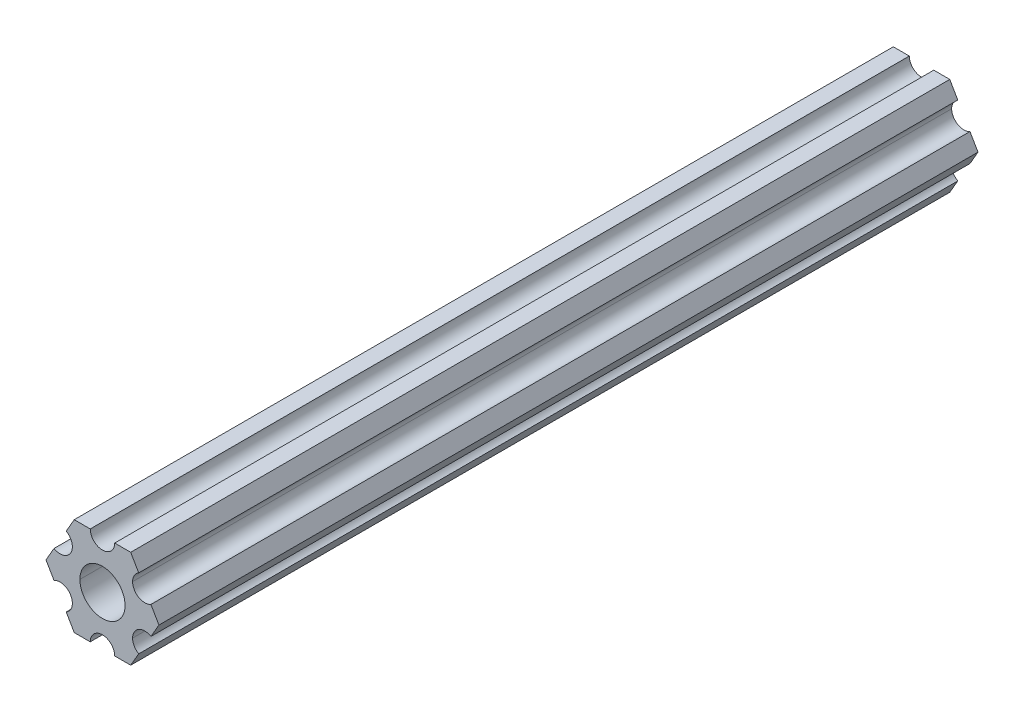
ISO-10303-21;
HEADER;
FILE_DESCRIPTION(('STEP AP214'),'2;1');
FILE_NAME('part.step','',(''),(''),'','','');
FILE_SCHEMA(('AUTOMOTIVE_DESIGN { 1 0 10303 214 1 1 1 1 }'));
ENDSEC;
DATA;
#1=APPLICATION_CONTEXT('core data for automotive mechanical design processes');
#2=APPLICATION_PROTOCOL_DEFINITION('international standard','automotive_design',2000,#1);
#3=PRODUCT_CONTEXT('',#1,'mechanical');
#4=PRODUCT('Part','Part','',(#3));
#5=PRODUCT_RELATED_PRODUCT_CATEGORY('part','',(#4));
#6=PRODUCT_DEFINITION_FORMATION('','',#4);
#7=PRODUCT_DEFINITION_CONTEXT('part definition',#1,'design');
#8=PRODUCT_DEFINITION('design','',#6,#7);
#9=PRODUCT_DEFINITION_SHAPE('','',#8);
#10=(LENGTH_UNIT() NAMED_UNIT(*) SI_UNIT(.MILLI.,.METRE.));
#11=(NAMED_UNIT(*) PLANE_ANGLE_UNIT() SI_UNIT($,.RADIAN.));
#12=(NAMED_UNIT(*) SI_UNIT($,.STERADIAN.) SOLID_ANGLE_UNIT());
#13=UNCERTAINTY_MEASURE_WITH_UNIT(LENGTH_MEASURE(1.E-05),#10,'distance_accuracy_value','');
#14=(GEOMETRIC_REPRESENTATION_CONTEXT(3) GLOBAL_UNCERTAINTY_ASSIGNED_CONTEXT((#13)) GLOBAL_UNIT_ASSIGNED_CONTEXT((#10,
#11,#12)) REPRESENTATION_CONTEXT('',''));
#15=CARTESIAN_POINT('',(0.,0.,0.));
#16=DIRECTION('',(0.,0.,1.));
#17=DIRECTION('',(1.,0.,0.));
#18=AXIS2_PLACEMENT_3D('',#15,#16,#17);
#19=CARTESIAN_POINT('',(0.,0.,304.8));
#20=DIRECTION('',(0.,0.,-1.));
#21=DIRECTION('',(-1.,0.,0.));
#22=AXIS2_PLACEMENT_3D('',#19,#20,#21);
#23=CYLINDRICAL_SURFACE('',#22,2.9337);
#24=CARTESIAN_POINT('',(0.,0.,106.3625));
#25=DIRECTION('',(0.,0.,1.));
#26=DIRECTION('',(1.,0.,0.));
#27=AXIS2_PLACEMENT_3D('',#24,#25,#26);
#28=CIRCLE('',#27,2.9337);
#29=CARTESIAN_POINT('',(2.9337,0.,106.3625));
#30=VERTEX_POINT('',#29);
#31=CARTESIAN_POINT('',(-2.9337,0.,106.3625));
#32=VERTEX_POINT('',#31);
#33=EDGE_CURVE('E75',#30,#32,#28,.T.);
#34=ORIENTED_EDGE('',*,*,#33,.T.);
#35=DIRECTION('',(0.,0.,-1.));
#36=VECTOR('',#35,1.);
#37=CARTESIAN_POINT('',(-2.9337,0.,304.8));
#38=LINE('',#37,#36);
#39=CARTESIAN_POINT('',(-2.9337,0.,0.));
#40=VERTEX_POINT('',#39);
#41=EDGE_CURVE('E360',#32,#40,#38,.T.);
#42=ORIENTED_EDGE('',*,*,#41,.T.);
#43=CARTESIAN_POINT('',(0.,0.,0.));
#44=DIRECTION('',(0.,0.,1.));
#45=DIRECTION('',(1.,0.,0.));
#46=AXIS2_PLACEMENT_3D('',#43,#44,#45);
#47=CIRCLE('',#46,2.9337);
#48=CARTESIAN_POINT('',(2.9337,0.,0.));
#49=VERTEX_POINT('',#48);
#50=EDGE_CURVE('E332',#49,#40,#47,.T.);
#51=ORIENTED_EDGE('',*,*,#50,.F.);
#52=DIRECTION('',(0.,0.,-1.));
#53=VECTOR('',#52,1.);
#54=CARTESIAN_POINT('',(2.9337,0.,304.8));
#55=LINE('',#54,#53);
#56=EDGE_CURVE('E364',#30,#49,#55,.T.);
#57=ORIENTED_EDGE('',*,*,#56,.F.);
#58=EDGE_LOOP('',(#34,#42,#51,#57));
#59=FACE_BOUND('',#58,.T.);
#60=ADVANCED_FACE('F53',(#59),#23,.F.);
#61=CARTESIAN_POINT('',(5.49926150638082,-3.17499966684067,304.8));
#62=DIRECTION('',(0.,0.,-1.));
#63=DIRECTION('',(-1.,0.,0.));
#64=AXIS2_PLACEMENT_3D('',#61,#62,#63);
#65=CYLINDRICAL_SURFACE('',#64,1.5875);
#66=CARTESIAN_POINT('',(5.4992615063808,-3.17499966684069,106.3625));
#67=DIRECTION('',(0.,0.,-1.));
#68=DIRECTION('',(1.,0.,0.));
#69=AXIS2_PLACEMENT_3D('',#66,#67,#68);
#70=CIRCLE('',#69,1.5875);
#71=CARTESIAN_POINT('',(4.70551169873047,-4.54981510640161,106.3625));
#72=VERTEX_POINT('',#71);
#73=CARTESIAN_POINT('',(3.91176150638082,-3.17499966684067,106.3625));
#74=VERTEX_POINT('',#73);
#75=EDGE_CURVE('E69',#72,#74,#70,.T.);
#76=ORIENTED_EDGE('',*,*,#75,.F.);
#77=DIRECTION('',(0.,0.,-1.));
#78=VECTOR('',#77,1.);
#79=CARTESIAN_POINT('',(4.70551158967065,-4.54981504343587,304.8));
#80=LINE('',#79,#78);
#81=CARTESIAN_POINT('',(4.70551158967065,-4.54981504343587,0.));
#82=VERTEX_POINT('',#81);
#83=EDGE_CURVE('E62',#72,#82,#80,.T.);
#84=ORIENTED_EDGE('',*,*,#83,.T.);
#85=CARTESIAN_POINT('',(5.49926150638082,-3.17499966684067,0.));
#86=DIRECTION('',(0.,0.,-1.));
#87=DIRECTION('',(1.,0.,0.));
#88=AXIS2_PLACEMENT_3D('',#85,#86,#87);
#89=CIRCLE('',#88,1.5875);
#90=CARTESIAN_POINT('',(3.91176150638082,-3.17499966684067,0.));
#91=VERTEX_POINT('',#90);
#92=EDGE_CURVE('E301',#82,#91,#89,.T.);
#93=ORIENTED_EDGE('',*,*,#92,.T.);
#94=DIRECTION('',(0.,0.,-1.));
#95=VECTOR('',#94,1.);
#96=CARTESIAN_POINT('',(3.91176150638082,-3.17499966684067,304.8));
#97=LINE('',#96,#95);
#98=EDGE_CURVE('E356',#74,#91,#97,.T.);
#99=ORIENTED_EDGE('',*,*,#98,.F.);
#100=EDGE_LOOP('',(#76,#84,#93,#99));
#101=FACE_BOUND('',#100,.T.);
#102=ADVANCED_FACE('F769',(#101),#65,.F.);
#103=CARTESIAN_POINT('',(3.66617459405346,-6.34999977789375,304.8));
#104=DIRECTION('',(-0.86602543407573,0.499999947533941,0.));
#105=DIRECTION('',(0.,0.,1.));
#106=AXIS2_PLACEMENT_3D('',#103,#104,#105);
#107=PLANE('',#106);
#108=DIRECTION('',(0.500000000000004,0.866025403784436,0.));
#109=VECTOR('',#108,1.);
#110=CARTESIAN_POINT('',(4.70551169873047,-4.54981510640161,106.3625));
#111=LINE('',#110,#109);
#112=CARTESIAN_POINT('',(3.66617459405343,-6.34999977789377,106.3625));
#113=VERTEX_POINT('',#112);
#114=EDGE_CURVE('E436',#113,#72,#111,.T.);
#115=ORIENTED_EDGE('',*,*,#114,.F.);
#116=DIRECTION('',(0.,0.,-1.));
#117=VECTOR('',#116,1.);
#118=CARTESIAN_POINT('',(3.66617459405346,-6.34999977789375,304.8));
#119=LINE('',#118,#117);
#120=CARTESIAN_POINT('',(3.66617459405346,-6.34999977789375,0.));
#121=VERTEX_POINT('',#120);
#122=EDGE_CURVE('E318',#113,#121,#119,.T.);
#123=ORIENTED_EDGE('',*,*,#122,.T.);
#124=DIRECTION('',(0.499999947533941,0.86602543407573,0.));
#125=VECTOR('',#124,1.);
#126=CARTESIAN_POINT('',(3.66617459405346,-6.34999977789375,0.));
#127=LINE('',#126,#125);
#128=EDGE_CURVE('E340',#121,#82,#127,.T.);
#129=ORIENTED_EDGE('',*,*,#128,.T.);
#130=ORIENTED_EDGE('',*,*,#83,.F.);
#131=EDGE_LOOP('',(#115,#123,#129,#130));
#132=FACE_BOUND('',#131,.T.);
#133=ADVANCED_FACE('F777',(#132),#107,.F.);
#134=CARTESIAN_POINT('',(1.58750038469926,-6.34999990382518,304.8));
#135=DIRECTION('',(-6.05825721258438E-08,1.,0.));
#136=DIRECTION('',(0.,0.,1.));
#137=AXIS2_PLACEMENT_3D('',#134,#135,#136);
#138=PLANE('',#137);
#139=DIRECTION('',(0.999999999999998,6.05825725431102E-08,0.));
#140=VECTOR('',#139,1.);
#141=CARTESIAN_POINT('',(3.66617459405343,-6.34999977789377,106.3625));
#142=LINE('',#141,#140);
#143=CARTESIAN_POINT('',(1.58750038469922,-6.3499999038252,106.3625));
#144=VERTEX_POINT('',#143);
#145=EDGE_CURVE('E433',#144,#113,#142,.T.);
#146=ORIENTED_EDGE('',*,*,#145,.F.);
#147=DIRECTION('',(0.,0.,-1.));
#148=VECTOR('',#147,1.);
#149=CARTESIAN_POINT('',(1.58750038469926,-6.34999990382518,304.8));
#150=LINE('',#149,#148);
#151=CARTESIAN_POINT('',(1.58750038469926,-6.34999990382518,0.));
#152=VERTEX_POINT('',#151);
#153=EDGE_CURVE('E333',#144,#152,#150,.T.);
#154=ORIENTED_EDGE('',*,*,#153,.T.);
#155=DIRECTION('',(1.,6.05825721258438E-08,0.));
#156=VECTOR('',#155,1.);
#157=CARTESIAN_POINT('',(1.58750038469926,-6.34999990382518,0.));
#158=LINE('',#157,#156);
#159=EDGE_CURVE('E350',#152,#121,#158,.T.);
#160=ORIENTED_EDGE('',*,*,#159,.T.);
#161=ORIENTED_EDGE('',*,*,#122,.F.);
#162=EDGE_LOOP('',(#146,#154,#160,#161));
#163=FACE_BOUND('',#162,.T.);
#164=ADVANCED_FACE('F785',(#163),#138,.F.);
#165=CARTESIAN_POINT('',(3.8469926204343E-07,-6.35,304.8));
#166=DIRECTION('',(0.,0.,-1.));
#167=DIRECTION('',(-1.,0.,0.));
#168=AXIS2_PLACEMENT_3D('',#165,#166,#167);
#169=CYLINDRICAL_SURFACE('',#168,1.5875);
#170=CARTESIAN_POINT('',(3.8469921571851E-07,-6.35,106.3625));
#171=DIRECTION('',(0.,0.,-1.));
#172=DIRECTION('',(1.,0.,0.));
#173=AXIS2_PLACEMENT_3D('',#170,#171,#172);
#174=CIRCLE('',#173,1.5875);
#175=CARTESIAN_POINT('',(-1.58749961530077,-6.35000022210626,106.3625));
#176=VERTEX_POINT('',#175);
#177=EDGE_CURVE('E430',#176,#144,#174,.T.);
#178=ORIENTED_EDGE('',*,*,#177,.F.);
#179=DIRECTION('',(0.,0.,-1.));
#180=VECTOR('',#179,1.);
#181=CARTESIAN_POINT('',(-1.58749961530073,-6.35000009617482,304.8));
#182=LINE('',#181,#180);
#183=CARTESIAN_POINT('',(-1.58749961530073,-6.35000009617482,0.));
#184=VERTEX_POINT('',#183);
#185=EDGE_CURVE('E336',#176,#184,#182,.T.);
#186=ORIENTED_EDGE('',*,*,#185,.T.);
#187=CARTESIAN_POINT('',(3.8469926204343E-07,-6.35,0.));
#188=DIRECTION('',(0.,0.,-1.));
#189=DIRECTION('',(1.,0.,0.));
#190=AXIS2_PLACEMENT_3D('',#187,#188,#189);
#191=CIRCLE('',#190,1.5875);
#192=EDGE_CURVE('E260',#184,#152,#191,.T.);
#193=ORIENTED_EDGE('',*,*,#192,.T.);
#194=ORIENTED_EDGE('',*,*,#153,.F.);
#195=EDGE_LOOP('',(#178,#186,#193,#194));
#196=FACE_BOUND('',#195,.T.);
#197=ADVANCED_FACE('F794',(#196),#169,.F.);
#198=CARTESIAN_POINT('',(-3.66617382465481,-6.35000022210628,304.8));
#199=DIRECTION('',(-6.05825854783851E-08,1.,0.));
#200=DIRECTION('',(0.,0.,1.));
#201=AXIS2_PLACEMENT_3D('',#198,#199,#200);
#202=PLANE('',#201);
#203=DIRECTION('',(1.,0.,0.));
#204=VECTOR('',#203,1.);
#205=CARTESIAN_POINT('',(-1.58749961530077,-6.35000022210626,106.3625));
#206=LINE('',#205,#204);
#207=CARTESIAN_POINT('',(-3.66617382465485,-6.35000022210624,106.3625));
#208=VERTEX_POINT('',#207);
#209=EDGE_CURVE('E427',#208,#176,#206,.T.);
#210=ORIENTED_EDGE('',*,*,#209,.F.);
#211=DIRECTION('',(0.,0.,-1.));
#212=VECTOR('',#211,1.);
#213=CARTESIAN_POINT('',(-3.66617382465481,-6.35000022210628,304.8));
#214=LINE('',#213,#212);
#215=CARTESIAN_POINT('',(-3.66617382465481,-6.35000022210628,0.));
#216=VERTEX_POINT('',#215);
#217=EDGE_CURVE('E305',#208,#216,#214,.T.);
#218=ORIENTED_EDGE('',*,*,#217,.T.);
#219=DIRECTION('',(1.,6.05825854783851E-08,0.));
#220=VECTOR('',#219,1.);
#221=CARTESIAN_POINT('',(-3.66617382465481,-6.35000022210628,0.));
#222=LINE('',#221,#220);
#223=EDGE_CURVE('E341',#216,#184,#222,.T.);
#224=ORIENTED_EDGE('',*,*,#223,.T.);
#225=ORIENTED_EDGE('',*,*,#185,.F.);
#226=EDGE_LOOP('',(#210,#218,#224,#225));
#227=FACE_BOUND('',#226,.T.);
#228=ADVANCED_FACE('F803',(#227),#202,.F.);
#229=CARTESIAN_POINT('',(-4.70551103839172,-4.54981561357972,304.8));
#230=DIRECTION('',(0.866025373493152,0.500000052466045,0.));
#231=DIRECTION('',(0.,0.,-1.));
#232=AXIS2_PLACEMENT_3D('',#229,#230,#231);
#233=PLANE('',#232);
#234=DIRECTION('',(0.500000052466044,-0.866025373493152,0.));
#235=VECTOR('',#234,1.);
#236=CARTESIAN_POINT('',(-3.66617382465485,-6.35000022210624,106.3625));
#237=LINE('',#236,#235);
#238=CARTESIAN_POINT('',(-4.70551103839177,-4.54981561357968,106.3625));
#239=VERTEX_POINT('',#238);
#240=EDGE_CURVE('E424',#239,#208,#237,.T.);
#241=ORIENTED_EDGE('',*,*,#240,.F.);
#242=DIRECTION('',(0.,0.,-1.));
#243=VECTOR('',#242,1.);
#244=CARTESIAN_POINT('',(-4.70551103839172,-4.54981561357972,304.8));
#245=LINE('',#244,#243);
#246=CARTESIAN_POINT('',(-4.70551103839172,-4.54981561357972,0.));
#247=VERTEX_POINT('',#246);
#248=EDGE_CURVE('E302',#239,#247,#245,.T.);
#249=ORIENTED_EDGE('',*,*,#248,.T.);
#250=DIRECTION('',(0.500000052466045,-0.866025373493152,0.));
#251=VECTOR('',#250,1.);
#252=CARTESIAN_POINT('',(-4.70551103839172,-4.54981561357972,0.));
#253=LINE('',#252,#251);
#254=EDGE_CURVE('E328',#247,#216,#253,.T.);
#255=ORIENTED_EDGE('',*,*,#254,.T.);
#256=ORIENTED_EDGE('',*,*,#217,.F.);
#257=EDGE_LOOP('',(#241,#249,#255,#256));
#258=FACE_BOUND('',#257,.T.);
#259=ADVANCED_FACE('F55',(#258),#233,.F.);
#260=CARTESIAN_POINT('',(-5.49926112168156,-3.17500033315934,304.8));
#261=DIRECTION('',(0.,0.,-1.));
#262=DIRECTION('',(-1.,0.,0.));
#263=AXIS2_PLACEMENT_3D('',#260,#261,#262);
#264=CYLINDRICAL_SURFACE('',#263,1.5875);
#265=CARTESIAN_POINT('',(-5.49926112168158,-3.17500033315928,106.3625));
#266=DIRECTION('',(0.,0.,-1.));
#267=DIRECTION('',(1.,0.,0.));
#268=AXIS2_PLACEMENT_3D('',#265,#266,#267);
#269=CIRCLE('',#268,1.5875);
#270=CARTESIAN_POINT('',(-6.29301131403124,-1.80018511570462,106.3625));
#271=VERTEX_POINT('',#270);
#272=EDGE_CURVE('E421',#271,#239,#269,.T.);
#273=ORIENTED_EDGE('',*,*,#272,.F.);
#274=DIRECTION('',(0.,0.,-1.));
#275=VECTOR('',#274,1.);
#276=CARTESIAN_POINT('',(-6.29301120497141,-1.80018505273897,304.8));
#277=LINE('',#276,#275);
#278=CARTESIAN_POINT('',(-6.29301120497141,-1.80018505273897,0.));
#279=VERTEX_POINT('',#278);
#280=EDGE_CURVE('E306',#271,#279,#277,.T.);
#281=ORIENTED_EDGE('',*,*,#280,.T.);
#282=CARTESIAN_POINT('',(-5.49926112168156,-3.17500033315934,0.));
#283=DIRECTION('',(0.,0.,-1.));
#284=DIRECTION('',(1.,0.,0.));
#285=AXIS2_PLACEMENT_3D('',#282,#283,#284);
#286=CIRCLE('',#285,1.5875);
#287=EDGE_CURVE('E291',#279,#247,#286,.T.);
#288=ORIENTED_EDGE('',*,*,#287,.T.);
#289=ORIENTED_EDGE('',*,*,#248,.F.);
#290=EDGE_LOOP('',(#273,#281,#288,#289));
#291=FACE_BOUND('',#290,.T.);
#292=ADVANCED_FACE('F818',(#291),#264,.F.);
#293=CARTESIAN_POINT('',(-7.33234841870827,-4.44212523790841E-07,304.8));
#294=DIRECTION('',(0.866025373493151,0.500000052466045,0.));
#295=DIRECTION('',(0.,0.,-1.));
#296=AXIS2_PLACEMENT_3D('',#293,#294,#295);
#297=PLANE('',#296);
#298=DIRECTION('',(0.500000000000031,-0.866025403784421,0.));
#299=VECTOR('',#298,1.);
#300=CARTESIAN_POINT('',(-6.29301131403124,-1.80018511570462,106.3625));
#301=LINE('',#300,#299);
#302=CARTESIAN_POINT('',(-7.33234841870826,-4.44212631346432E-07,106.3625));
#303=VERTEX_POINT('',#302);
#304=EDGE_CURVE('E418',#303,#271,#301,.T.);
#305=ORIENTED_EDGE('',*,*,#304,.F.);
#306=DIRECTION('',(0.,0.,-1.));
#307=VECTOR('',#306,1.);
#308=CARTESIAN_POINT('',(-7.33234841870827,-4.44212523790841E-07,304.8));
#309=LINE('',#308,#307);
#310=CARTESIAN_POINT('',(-7.33234841870827,-4.44212523790841E-07,0.));
#311=VERTEX_POINT('',#310);
#312=EDGE_CURVE('E254',#303,#311,#309,.T.);
#313=ORIENTED_EDGE('',*,*,#312,.T.);
#314=DIRECTION('',(0.500000052466045,-0.866025373493151,0.));
#315=VECTOR('',#314,1.);
#316=CARTESIAN_POINT('',(-7.33234841870827,-4.44212523790841E-07,0.));
#317=LINE('',#316,#315);
#318=EDGE_CURVE('E286',#311,#279,#317,.T.);
#319=ORIENTED_EDGE('',*,*,#318,.T.);
#320=ORIENTED_EDGE('',*,*,#280,.F.);
#321=EDGE_LOOP('',(#305,#313,#319,#320));
#322=FACE_BOUND('',#321,.T.);
#323=ADVANCED_FACE('F826',(#322),#297,.F.);
#324=CARTESIAN_POINT('',(-6.29301142309098,1.80018429024547,304.8));
#325=DIRECTION('',(0.866025434075724,-0.499999947533952,0.));
#326=DIRECTION('',(0.,0.,-1.));
#327=AXIS2_PLACEMENT_3D('',#324,#325,#326);
#328=PLANE('',#327);
#329=DIRECTION('',(-0.499999947533919,-0.866025434075743,0.));
#330=VECTOR('',#329,1.);
#331=CARTESIAN_POINT('',(-7.33234841870826,-4.44212631346432E-07,106.3625));
#332=LINE('',#331,#330);
#333=CARTESIAN_POINT('',(-6.29301142309097,1.80018429024554,106.3625));
#334=VERTEX_POINT('',#333);
#335=EDGE_CURVE('E242',#334,#303,#332,.T.);
#336=ORIENTED_EDGE('',*,*,#335,.F.);
#337=DIRECTION('',(0.,0.,-1.));
#338=VECTOR('',#337,1.);
#339=CARTESIAN_POINT('',(-6.29301142309098,1.80018429024547,304.8));
#340=LINE('',#339,#338);
#341=CARTESIAN_POINT('',(-6.29301142309098,1.80018429024547,0.));
#342=VERTEX_POINT('',#341);
#343=EDGE_CURVE('E240',#334,#342,#340,.T.);
#344=ORIENTED_EDGE('',*,*,#343,.T.);
#345=DIRECTION('',(-0.499999947533951,-0.866025434075724,0.));
#346=VECTOR('',#345,1.);
#347=CARTESIAN_POINT('',(-6.29301142309098,1.80018429024547,0.));
#348=LINE('',#347,#346);
#349=EDGE_CURVE('E290',#342,#311,#348,.T.);
#350=ORIENTED_EDGE('',*,*,#349,.T.);
#351=ORIENTED_EDGE('',*,*,#312,.F.);
#352=EDGE_LOOP('',(#336,#344,#350,#351));
#353=FACE_BOUND('',#352,.T.);
#354=ADVANCED_FACE('F835',(#353),#328,.F.);
#355=CARTESIAN_POINT('',(-5.49926150638082,3.17499966684067,304.8));
#356=DIRECTION('',(0.,0.,-1.));
#357=DIRECTION('',(-1.,0.,0.));
#358=AXIS2_PLACEMENT_3D('',#355,#356,#357);
#359=CYLINDRICAL_SURFACE('',#358,1.5875);
#360=CARTESIAN_POINT('',(-5.49926150638078,3.17499966684073,106.3625));
#361=DIRECTION('',(0.,0.,-1.));
#362=DIRECTION('',(1.,0.,0.));
#363=AXIS2_PLACEMENT_3D('',#360,#361,#362);
#364=CIRCLE('',#363,1.5875);
#365=CARTESIAN_POINT('',(-4.70551169873044,4.54981510640164,106.3625));
#366=VERTEX_POINT('',#365);
#367=EDGE_CURVE('E225',#366,#334,#364,.T.);
#368=ORIENTED_EDGE('',*,*,#367,.F.);
#369=DIRECTION('',(0.,0.,-1.));
#370=VECTOR('',#369,1.);
#371=CARTESIAN_POINT('',(-4.70551158967065,4.54981504343587,304.8));
#372=LINE('',#371,#370);
#373=CARTESIAN_POINT('',(-4.70551158967065,4.54981504343587,0.));
#374=VERTEX_POINT('',#373);
#375=EDGE_CURVE('E238',#366,#374,#372,.T.);
#376=ORIENTED_EDGE('',*,*,#375,.T.);
#377=CARTESIAN_POINT('',(-5.49926150638082,3.17499966684067,0.));
#378=DIRECTION('',(0.,0.,-1.));
#379=DIRECTION('',(1.,0.,0.));
#380=AXIS2_PLACEMENT_3D('',#377,#378,#379);
#381=CIRCLE('',#380,1.5875);
#382=EDGE_CURVE('E319',#374,#342,#381,.T.);
#383=ORIENTED_EDGE('',*,*,#382,.T.);
#384=ORIENTED_EDGE('',*,*,#343,.F.);
#385=EDGE_LOOP('',(#368,#376,#383,#384));
#386=FACE_BOUND('',#385,.T.);
#387=ADVANCED_FACE('F236',(#386),#359,.F.);
#388=CARTESIAN_POINT('',(-3.66617459405349,6.3499997778937,304.8));
#389=DIRECTION('',(0.866025434075729,-0.499999947533942,0.));
#390=DIRECTION('',(0.,0.,-1.));
#391=AXIS2_PLACEMENT_3D('',#388,#389,#390);
#392=PLANE('',#391);
#393=DIRECTION('',(-0.499999999999992,-0.866025403784443,0.));
#394=VECTOR('',#393,1.);
#395=CARTESIAN_POINT('',(-4.70551169873044,4.54981510640164,106.3625));
#396=LINE('',#395,#394);
#397=CARTESIAN_POINT('',(-3.66617459405349,6.3499997778937,106.3625));
#398=VERTEX_POINT('',#397);
#399=EDGE_CURVE('E222',#398,#366,#396,.T.);
#400=ORIENTED_EDGE('',*,*,#399,.F.);
#401=DIRECTION('',(0.,0.,-1.));
#402=VECTOR('',#401,1.);
#403=CARTESIAN_POINT('',(-3.66617459405349,6.3499997778937,304.8));
#404=LINE('',#403,#402);
#405=CARTESIAN_POINT('',(-3.66617459405349,6.3499997778937,0.));
#406=VERTEX_POINT('',#405);
#407=EDGE_CURVE('E249',#398,#406,#404,.T.);
#408=ORIENTED_EDGE('',*,*,#407,.T.);
#409=DIRECTION('',(-0.499999947533943,-0.866025434075729,0.));
#410=VECTOR('',#409,1.);
#411=CARTESIAN_POINT('',(-3.66617459405349,6.3499997778937,0.));
#412=LINE('',#411,#410);
#413=EDGE_CURVE('E246',#406,#374,#412,.T.);
#414=ORIENTED_EDGE('',*,*,#413,.T.);
#415=ORIENTED_EDGE('',*,*,#375,.F.);
#416=EDGE_LOOP('',(#400,#408,#414,#415));
#417=FACE_BOUND('',#416,.T.);
#418=ADVANCED_FACE('F244',(#417),#392,.F.);
#419=CARTESIAN_POINT('',(-1.58750038469926,6.34999990382518,304.8));
#420=DIRECTION('',(6.05825963273174E-08,-1.,0.));
#421=DIRECTION('',(0.,0.,-1.));
#422=AXIS2_PLACEMENT_3D('',#419,#420,#421);
#423=PLANE('',#422);
#424=DIRECTION('',(-0.999999999999998,-6.05826013345191E-08,0.));
#425=VECTOR('',#424,1.);
#426=CARTESIAN_POINT('',(-3.66617459405349,6.3499997778937,106.3625));
#427=LINE('',#426,#425);
#428=CARTESIAN_POINT('',(-1.58750038469926,6.34999990382519,106.3625));
#429=VERTEX_POINT('',#428);
#430=EDGE_CURVE('E228',#429,#398,#427,.T.);
#431=ORIENTED_EDGE('',*,*,#430,.F.);
#432=DIRECTION('',(0.,0.,-1.));
#433=VECTOR('',#432,1.);
#434=CARTESIAN_POINT('',(-1.58750038469926,6.34999990382519,304.8));
#435=LINE('',#434,#433);
#436=CARTESIAN_POINT('',(-1.58750038469926,6.34999990382519,0.));
#437=VERTEX_POINT('',#436);
#438=EDGE_CURVE('E256',#429,#437,#435,.T.);
#439=ORIENTED_EDGE('',*,*,#438,.T.);
#440=DIRECTION('',(-1.,-6.05825963273174E-08,0.));
#441=VECTOR('',#440,1.);
#442=CARTESIAN_POINT('',(-1.58750038469926,6.34999990382518,0.));
#443=LINE('',#442,#441);
#444=EDGE_CURVE('E272',#437,#406,#443,.T.);
#445=ORIENTED_EDGE('',*,*,#444,.T.);
#446=ORIENTED_EDGE('',*,*,#407,.F.);
#447=EDGE_LOOP('',(#431,#439,#445,#446));
#448=FACE_BOUND('',#447,.T.);
#449=ADVANCED_FACE('F508',(#448),#423,.F.);
#450=CARTESIAN_POINT('',(-3.84699260060323E-07,6.35,304.8));
#451=DIRECTION('',(0.,0.,-1.));
#452=DIRECTION('',(-1.,0.,0.));
#453=AXIS2_PLACEMENT_3D('',#450,#451,#452);
#454=CYLINDRICAL_SURFACE('',#453,1.5875);
#455=CARTESIAN_POINT('',(-3.84699260060323E-07,6.35,106.3625));
#456=DIRECTION('',(0.,0.,-1.));
#457=DIRECTION('',(1.,0.,0.));
#458=AXIS2_PLACEMENT_3D('',#455,#456,#457);
#459=CIRCLE('',#458,1.5875);
#460=CARTESIAN_POINT('',(1.58749961530073,6.35000022210627,106.3625));
#461=VERTEX_POINT('',#460);
#462=EDGE_CURVE('E458',#461,#429,#459,.T.);
#463=ORIENTED_EDGE('',*,*,#462,.F.);
#464=DIRECTION('',(0.,0.,-1.));
#465=VECTOR('',#464,1.);
#466=CARTESIAN_POINT('',(1.58749961530074,6.35000009617482,304.8));
#467=LINE('',#466,#465);
#468=CARTESIAN_POINT('',(1.58749961530074,6.35000009617482,0.));
#469=VERTEX_POINT('',#468);
#470=EDGE_CURVE('E315',#461,#469,#467,.T.);
#471=ORIENTED_EDGE('',*,*,#470,.T.);
#472=CARTESIAN_POINT('',(-3.84699260060323E-07,6.35,0.));
#473=DIRECTION('',(0.,0.,-1.));
#474=DIRECTION('',(1.,0.,0.));
#475=AXIS2_PLACEMENT_3D('',#472,#473,#474);
#476=CIRCLE('',#475,1.5875);
#477=EDGE_CURVE('E267',#469,#437,#476,.T.);
#478=ORIENTED_EDGE('',*,*,#477,.T.);
#479=ORIENTED_EDGE('',*,*,#438,.F.);
#480=EDGE_LOOP('',(#463,#471,#478,#479));
#481=FACE_BOUND('',#480,.T.);
#482=ADVANCED_FACE('F505',(#481),#454,.F.);
#483=CARTESIAN_POINT('',(3.66617382465481,6.35000022210627,304.8));
#484=DIRECTION('',(6.05825850611185E-08,-1.,0.));
#485=DIRECTION('',(0.,0.,-1.));
#486=AXIS2_PLACEMENT_3D('',#483,#484,#485);
#487=PLANE('',#486);
#488=DIRECTION('',(-1.,0.,0.));
#489=VECTOR('',#488,1.);
#490=CARTESIAN_POINT('',(1.58749961530073,6.35000022210627,106.3625));
#491=LINE('',#490,#489);
#492=CARTESIAN_POINT('',(3.66617382465481,6.35000022210627,106.3625));
#493=VERTEX_POINT('',#492);
#494=EDGE_CURVE('E455',#493,#461,#491,.T.);
#495=ORIENTED_EDGE('',*,*,#494,.F.);
#496=DIRECTION('',(0.,0.,-1.));
#497=VECTOR('',#496,1.);
#498=CARTESIAN_POINT('',(3.66617382465481,6.35000022210627,304.8));
#499=LINE('',#498,#497);
#500=CARTESIAN_POINT('',(3.66617382465481,6.35000022210627,0.));
#501=VERTEX_POINT('',#500);
#502=EDGE_CURVE('E280',#493,#501,#499,.T.);
#503=ORIENTED_EDGE('',*,*,#502,.T.);
#504=DIRECTION('',(-1.,-6.05825850611185E-08,0.));
#505=VECTOR('',#504,1.);
#506=CARTESIAN_POINT('',(3.66617382465481,6.35000022210627,0.));
#507=LINE('',#506,#505);
#508=EDGE_CURVE('E271',#501,#469,#507,.T.);
#509=ORIENTED_EDGE('',*,*,#508,.T.);
#510=ORIENTED_EDGE('',*,*,#470,.F.);
#511=EDGE_LOOP('',(#495,#503,#509,#510));
#512=FACE_BOUND('',#511,.T.);
#513=ADVANCED_FACE('F499',(#512),#487,.F.);
#514=CARTESIAN_POINT('',(4.70551103839172,4.54981561357972,304.8));
#515=DIRECTION('',(-0.866025373493151,-0.500000052466046,0.));
#516=DIRECTION('',(-0.500000052466046,0.866025373493151,0.));
#517=AXIS2_PLACEMENT_3D('',#514,#515,#516);
#518=PLANE('',#517);
#519=DIRECTION('',(-0.50000005246605,0.866025373493148,0.));
#520=VECTOR('',#519,1.);
#521=CARTESIAN_POINT('',(3.66617382465481,6.35000022210627,106.3625));
#522=LINE('',#521,#520);
#523=CARTESIAN_POINT('',(4.70551103839174,4.54981561357971,106.3625));
#524=VERTEX_POINT('',#523);
#525=EDGE_CURVE('E452',#524,#493,#522,.T.);
#526=ORIENTED_EDGE('',*,*,#525,.F.);
#527=DIRECTION('',(0.,0.,-1.));
#528=VECTOR('',#527,1.);
#529=CARTESIAN_POINT('',(4.70551103839172,4.54981561357972,304.8));
#530=LINE('',#529,#528);
#531=CARTESIAN_POINT('',(4.70551103839172,4.54981561357972,0.));
#532=VERTEX_POINT('',#531);
#533=EDGE_CURVE('E276',#524,#532,#530,.T.);
#534=ORIENTED_EDGE('',*,*,#533,.T.);
#535=DIRECTION('',(-0.500000052466046,0.866025373493151,0.));
#536=VECTOR('',#535,1.);
#537=CARTESIAN_POINT('',(4.70551103839172,4.54981561357972,0.));
#538=LINE('',#537,#536);
#539=EDGE_CURVE('E285',#532,#501,#538,.T.);
#540=ORIENTED_EDGE('',*,*,#539,.T.);
#541=ORIENTED_EDGE('',*,*,#502,.F.);
#542=EDGE_LOOP('',(#526,#534,#540,#541));
#543=FACE_BOUND('',#542,.T.);
#544=ADVANCED_FACE('F495',(#543),#518,.F.);
#545=CARTESIAN_POINT('',(5.49926112168156,3.17500033315934,304.8));
#546=DIRECTION('',(0.,0.,-1.));
#547=DIRECTION('',(-1.,0.,0.));
#548=AXIS2_PLACEMENT_3D('',#545,#546,#547);
#549=CYLINDRICAL_SURFACE('',#548,1.5875);
#550=CARTESIAN_POINT('',(5.49926112168156,3.17500033315932,106.3625));
#551=DIRECTION('',(0.,0.,-1.));
#552=DIRECTION('',(1.,0.,0.));
#553=AXIS2_PLACEMENT_3D('',#550,#551,#552);
#554=CIRCLE('',#553,1.5875);
#555=CARTESIAN_POINT('',(6.29301131403122,1.80018511570467,106.3625));
#556=VERTEX_POINT('',#555);
#557=CARTESIAN_POINT('',(3.91176112168156,3.17500033315934,106.3625));
#558=VERTEX_POINT('',#557);
#559=EDGE_CURVE('E449',#556,#558,#554,.T.);
#560=ORIENTED_EDGE('',*,*,#559,.F.);
#561=DIRECTION('',(0.,0.,-1.));
#562=VECTOR('',#561,1.);
#563=CARTESIAN_POINT('',(6.29301120497139,1.80018505273894,304.8));
#564=LINE('',#563,#562);
#565=CARTESIAN_POINT('',(6.29301120497139,1.80018505273894,0.));
#566=VERTEX_POINT('',#565);
#567=EDGE_CURVE('E277',#556,#566,#564,.T.);
#568=ORIENTED_EDGE('',*,*,#567,.T.);
#569=CARTESIAN_POINT('',(5.49926112168156,3.17500033315934,0.));
#570=DIRECTION('',(0.,0.,-1.));
#571=DIRECTION('',(1.,0.,0.));
#572=AXIS2_PLACEMENT_3D('',#569,#570,#571);
#573=CIRCLE('',#572,1.5875);
#574=CARTESIAN_POINT('',(3.91176112168156,3.17500033315934,0.));
#575=VERTEX_POINT('',#574);
#576=EDGE_CURVE('E292',#566,#575,#573,.T.);
#577=ORIENTED_EDGE('',*,*,#576,.T.);
#578=DIRECTION('',(0.,0.,-1.));
#579=VECTOR('',#578,1.);
#580=CARTESIAN_POINT('',(3.91176112168156,3.17500033315934,304.8));
#581=LINE('',#580,#579);
#582=EDGE_CURVE('E262',#558,#575,#581,.T.);
#583=ORIENTED_EDGE('',*,*,#582,.F.);
#584=EDGE_LOOP('',(#560,#568,#577,#583));
#585=FACE_BOUND('',#584,.T.);
#586=ADVANCED_FACE('F487',(#585),#549,.F.);
#587=CARTESIAN_POINT('',(7.33234841870827,4.44212519169686E-07,304.8));
#588=DIRECTION('',(-0.866025373493145,-0.500000052466057,0.));
#589=DIRECTION('',(-0.500000052466057,0.866025373493145,0.));
#590=AXIS2_PLACEMENT_3D('',#587,#588,#589);
#591=PLANE('',#590);
#592=DIRECTION('',(-0.499999999999998,0.86602540378444,0.));
#593=VECTOR('',#592,1.);
#594=CARTESIAN_POINT('',(6.29301131403122,1.80018511570467,106.3625));
#595=LINE('',#594,#593);
#596=CARTESIAN_POINT('',(7.33234841870826,4.44212500550628E-07,106.3625));
#597=VERTEX_POINT('',#596);
#598=EDGE_CURVE('E445',#597,#556,#595,.T.);
#599=ORIENTED_EDGE('',*,*,#598,.F.);
#600=DIRECTION('',(0.,0.,-1.));
#601=VECTOR('',#600,1.);
#602=CARTESIAN_POINT('',(7.33234841870827,4.44212519169686E-07,304.8));
#603=LINE('',#602,#601);
#604=CARTESIAN_POINT('',(7.33234841870827,4.44212519169686E-07,0.));
#605=VERTEX_POINT('',#604);
#606=EDGE_CURVE('E281',#597,#605,#603,.T.);
#607=ORIENTED_EDGE('',*,*,#606,.T.);
#608=DIRECTION('',(-0.500000052466056,0.866025373493145,0.));
#609=VECTOR('',#608,1.);
#610=CARTESIAN_POINT('',(7.33234841870827,4.44212519169686E-07,0.));
#611=LINE('',#610,#609);
#612=EDGE_CURVE('E296',#605,#566,#611,.T.);
#613=ORIENTED_EDGE('',*,*,#612,.T.);
#614=ORIENTED_EDGE('',*,*,#567,.F.);
#615=EDGE_LOOP('',(#599,#607,#613,#614));
#616=FACE_BOUND('',#615,.T.);
#617=ADVANCED_FACE('F482',(#616),#591,.F.);
#618=CARTESIAN_POINT('',(6.29301142309098,-1.80018429024546,304.8));
#619=DIRECTION('',(-0.866025434075723,0.499999947533953,0.));
#620=DIRECTION('',(0.,0.,1.));
#621=AXIS2_PLACEMENT_3D('',#618,#619,#620);
#622=PLANE('',#621);
#623=DIRECTION('',(0.499999947533949,0.866025434075725,0.));
#624=VECTOR('',#623,1.);
#625=CARTESIAN_POINT('',(7.33234841870826,4.44212500550628E-07,106.3625));
#626=LINE('',#625,#624);
#627=CARTESIAN_POINT('',(6.29301142309098,-1.8001842902455,106.3625));
#628=VERTEX_POINT('',#627);
#629=EDGE_CURVE('E442',#628,#597,#626,.T.);
#630=ORIENTED_EDGE('',*,*,#629,.F.);
#631=DIRECTION('',(0.,0.,-1.));
#632=VECTOR('',#631,1.);
#633=CARTESIAN_POINT('',(6.29301142309098,-1.80018429024546,304.8));
#634=LINE('',#633,#632);
#635=CARTESIAN_POINT('',(6.29301142309098,-1.80018429024546,0.));
#636=VERTEX_POINT('',#635);
#637=EDGE_CURVE('E266',#628,#636,#634,.T.);
#638=ORIENTED_EDGE('',*,*,#637,.T.);
#639=DIRECTION('',(0.499999947533953,0.866025434075723,0.));
#640=VECTOR('',#639,1.);
#641=CARTESIAN_POINT('',(6.29301142309098,-1.80018429024546,0.));
#642=LINE('',#641,#640);
#643=EDGE_CURVE('E297',#636,#605,#642,.T.);
#644=ORIENTED_EDGE('',*,*,#643,.T.);
#645=ORIENTED_EDGE('',*,*,#606,.F.);
#646=EDGE_LOOP('',(#630,#638,#644,#645));
#647=FACE_BOUND('',#646,.T.);
#648=ADVANCED_FACE('F471',(#647),#622,.F.);
#649=CARTESIAN_POINT('',(5.49926112168156,3.17500033315934,304.8));
#650=DIRECTION('',(0.,0.,-1.));
#651=DIRECTION('',(-1.,0.,0.));
#652=AXIS2_PLACEMENT_3D('',#649,#650,#651);
#653=CYLINDRICAL_SURFACE('',#652,1.5875);
#654=EDGE_CURVE('E448',#558,#524,#554,.T.);
#655=ORIENTED_EDGE('',*,*,#654,.F.);
#656=ORIENTED_EDGE('',*,*,#582,.T.);
#657=CARTESIAN_POINT('',(5.49926112168156,3.17500033315934,0.));
#658=DIRECTION('',(0.,0.,-1.));
#659=DIRECTION('',(1.,0.,0.));
#660=AXIS2_PLACEMENT_3D('',#657,#658,#659);
#661=CIRCLE('',#660,1.5875);
#662=EDGE_CURVE('E265',#575,#532,#661,.T.);
#663=ORIENTED_EDGE('',*,*,#662,.T.);
#664=ORIENTED_EDGE('',*,*,#533,.F.);
#665=EDGE_LOOP('',(#655,#656,#663,#664));
#666=FACE_BOUND('',#665,.T.);
#667=ADVANCED_FACE('F489',(#666),#653,.F.);
#668=CARTESIAN_POINT('',(5.49926150638082,-3.17499966684067,304.8));
#669=DIRECTION('',(0.,0.,-1.));
#670=DIRECTION('',(-1.,0.,0.));
#671=AXIS2_PLACEMENT_3D('',#668,#669,#670);
#672=CYLINDRICAL_SURFACE('',#671,1.5875);
#673=EDGE_CURVE('E439',#74,#628,#70,.T.);
#674=ORIENTED_EDGE('',*,*,#673,.F.);
#675=ORIENTED_EDGE('',*,*,#98,.T.);
#676=CARTESIAN_POINT('',(5.49926150638082,-3.17499966684067,0.));
#677=DIRECTION('',(0.,0.,-1.));
#678=DIRECTION('',(1.,0.,0.));
#679=AXIS2_PLACEMENT_3D('',#676,#677,#678);
#680=CIRCLE('',#679,1.5875);
#681=EDGE_CURVE('E309',#91,#636,#680,.T.);
#682=ORIENTED_EDGE('',*,*,#681,.T.);
#683=ORIENTED_EDGE('',*,*,#637,.F.);
#684=EDGE_LOOP('',(#674,#675,#682,#683));
#685=FACE_BOUND('',#684,.T.);
#686=ADVANCED_FACE('F473',(#685),#672,.F.);
#687=CARTESIAN_POINT('',(0.,0.,304.8));
#688=DIRECTION('',(0.,0.,-1.));
#689=DIRECTION('',(-1.,0.,0.));
#690=AXIS2_PLACEMENT_3D('',#687,#688,#689);
#691=CYLINDRICAL_SURFACE('',#690,2.9337);
#692=CARTESIAN_POINT('',(0.,0.,106.3625));
#693=DIRECTION('',(0.,0.,1.));
#694=DIRECTION('',(1.,0.,0.));
#695=AXIS2_PLACEMENT_3D('',#692,#693,#694);
#696=CIRCLE('',#695,2.9337);
#697=EDGE_CURVE('E11',#30,#32,#696,.F.);
#698=ORIENTED_EDGE('',*,*,#697,.F.);
#699=ORIENTED_EDGE('',*,*,#56,.T.);
#700=CARTESIAN_POINT('',(0.,0.,0.));
#701=DIRECTION('',(0.,0.,1.));
#702=DIRECTION('',(1.,0.,0.));
#703=AXIS2_PLACEMENT_3D('',#700,#701,#702);
#704=CIRCLE('',#703,2.9337);
#705=EDGE_CURVE('E366',#40,#49,#704,.T.);
#706=ORIENTED_EDGE('',*,*,#705,.F.);
#707=ORIENTED_EDGE('',*,*,#41,.F.);
#708=EDGE_LOOP('',(#698,#699,#706,#707));
#709=FACE_BOUND('',#708,.T.);
#710=ADVANCED_FACE('F412',(#709),#691,.F.);
#711=CARTESIAN_POINT('',(5.49926112168156,3.17500033315934,0.));
#712=DIRECTION('',(0.,0.,1.));
#713=DIRECTION('',(1.,0.,0.));
#714=AXIS2_PLACEMENT_3D('',#711,#712,#713);
#715=PLANE('',#714);
#716=ORIENTED_EDGE('',*,*,#705,.T.);
#717=ORIENTED_EDGE('',*,*,#50,.T.);
#718=EDGE_LOOP('',(#716,#717));
#719=FACE_BOUND('',#718,.T.);
#720=ORIENTED_EDGE('',*,*,#643,.F.);
#721=ORIENTED_EDGE('',*,*,#681,.F.);
#722=ORIENTED_EDGE('',*,*,#92,.F.);
#723=ORIENTED_EDGE('',*,*,#128,.F.);
#724=ORIENTED_EDGE('',*,*,#159,.F.);
#725=ORIENTED_EDGE('',*,*,#192,.F.);
#726=ORIENTED_EDGE('',*,*,#223,.F.);
#727=ORIENTED_EDGE('',*,*,#254,.F.);
#728=ORIENTED_EDGE('',*,*,#287,.F.);
#729=ORIENTED_EDGE('',*,*,#318,.F.);
#730=ORIENTED_EDGE('',*,*,#349,.F.);
#731=ORIENTED_EDGE('',*,*,#382,.F.);
#732=ORIENTED_EDGE('',*,*,#413,.F.);
#733=ORIENTED_EDGE('',*,*,#444,.F.);
#734=ORIENTED_EDGE('',*,*,#477,.F.);
#735=ORIENTED_EDGE('',*,*,#508,.F.);
#736=ORIENTED_EDGE('',*,*,#539,.F.);
#737=ORIENTED_EDGE('',*,*,#662,.F.);
#738=ORIENTED_EDGE('',*,*,#576,.F.);
#739=ORIENTED_EDGE('',*,*,#612,.F.);
#740=EDGE_LOOP('',(#720,#721,#722,#723,#724,#725,#726,#727,#728,#729,#730,#731,#732,#733,#734,
#735,#736,#737,#738,#739));
#741=FACE_BOUND('',#740,.T.);
#742=ADVANCED_FACE('F408',(#719,#741),#715,.F.);
#743=CARTESIAN_POINT('',(-3.84699260060323E-07,6.35,106.3625));
#744=DIRECTION('',(0.,0.,1.));
#745=DIRECTION('',(1.,0.,0.));
#746=AXIS2_PLACEMENT_3D('',#743,#744,#745);
#747=PLANE('',#746);
#748=ORIENTED_EDGE('',*,*,#33,.F.);
#749=ORIENTED_EDGE('',*,*,#697,.T.);
#750=EDGE_LOOP('',(#748,#749));
#751=FACE_BOUND('',#750,.T.);
#752=ORIENTED_EDGE('',*,*,#399,.T.);
#753=ORIENTED_EDGE('',*,*,#367,.T.);
#754=ORIENTED_EDGE('',*,*,#335,.T.);
#755=ORIENTED_EDGE('',*,*,#304,.T.);
#756=ORIENTED_EDGE('',*,*,#272,.T.);
#757=ORIENTED_EDGE('',*,*,#240,.T.);
#758=ORIENTED_EDGE('',*,*,#209,.T.);
#759=ORIENTED_EDGE('',*,*,#177,.T.);
#760=ORIENTED_EDGE('',*,*,#145,.T.);
#761=ORIENTED_EDGE('',*,*,#114,.T.);
#762=ORIENTED_EDGE('',*,*,#75,.T.);
#763=ORIENTED_EDGE('',*,*,#673,.T.);
#764=ORIENTED_EDGE('',*,*,#629,.T.);
#765=ORIENTED_EDGE('',*,*,#598,.T.);
#766=ORIENTED_EDGE('',*,*,#559,.T.);
#767=ORIENTED_EDGE('',*,*,#654,.T.);
#768=ORIENTED_EDGE('',*,*,#525,.T.);
#769=ORIENTED_EDGE('',*,*,#494,.T.);
#770=ORIENTED_EDGE('',*,*,#462,.T.);
#771=ORIENTED_EDGE('',*,*,#430,.T.);
#772=EDGE_LOOP('',(#752,#753,#754,#755,#756,#757,#758,#759,#760,#761,#762,#763,#764,#765,#766,
#767,#768,#769,#770,#771));
#773=FACE_BOUND('',#772,.T.);
#774=ADVANCED_FACE('F224',(#751,#773),#747,.T.);
#775=CLOSED_SHELL('',(#60,#102,#133,#164,#197,#228,#259,#292,#323,#354,#387,#418,#449,#482,#513,
#544,#586,#617,#648,#667,#686,#710,#742,#774));
#776=MANIFOLD_SOLID_BREP('B2',#775);
#777=ADVANCED_BREP_SHAPE_REPRESENTATION('',(#18,#776),#14);
#778=SHAPE_DEFINITION_REPRESENTATION(#9,#777);
ENDSEC;
END-ISO-10303-21;
